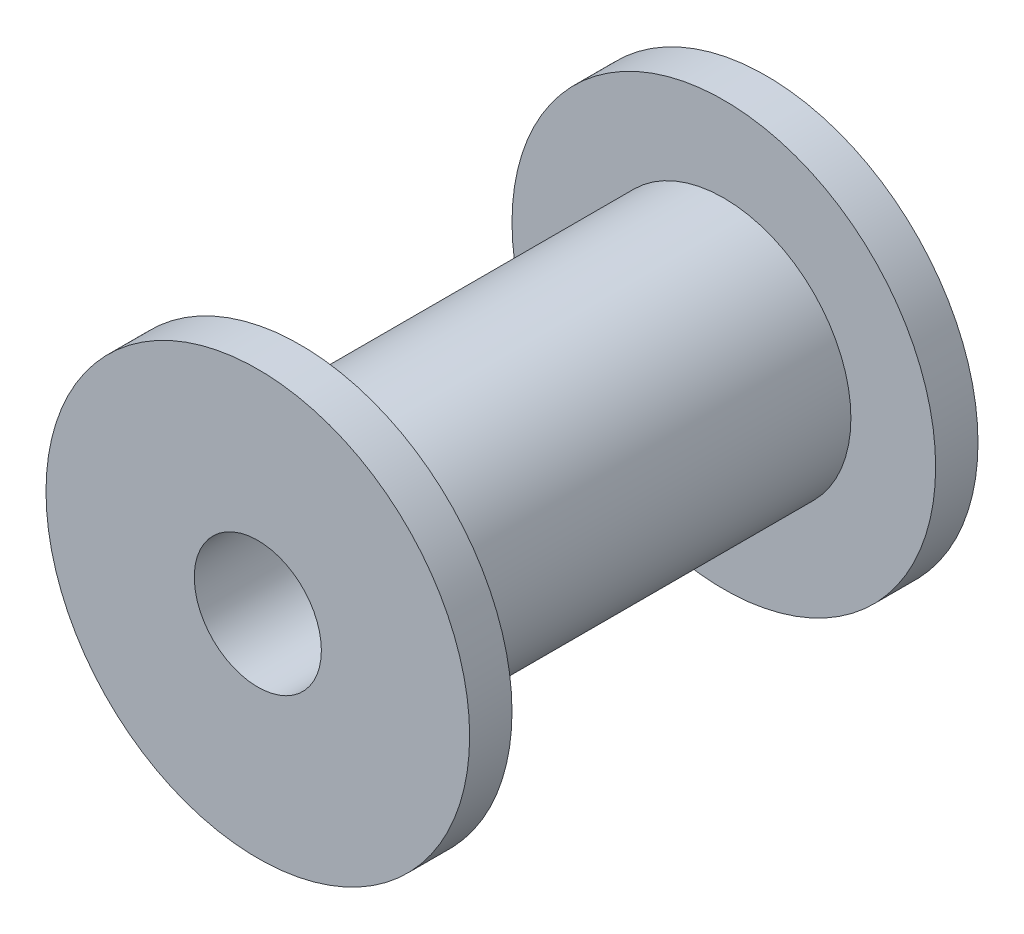
ISO-10303-21;
HEADER;
FILE_DESCRIPTION(('STEP AP214'),'2;1');
FILE_NAME('part.step','',(''),(''),'','','');
FILE_SCHEMA(('AUTOMOTIVE_DESIGN { 1 0 10303 214 1 1 1 1 }'));
ENDSEC;
DATA;
#1=APPLICATION_CONTEXT('core data for automotive mechanical design processes');
#2=APPLICATION_PROTOCOL_DEFINITION('international standard','automotive_design',2000,#1);
#3=PRODUCT_CONTEXT('',#1,'mechanical');
#4=PRODUCT('Part','Part','',(#3));
#5=PRODUCT_RELATED_PRODUCT_CATEGORY('part','',(#4));
#6=PRODUCT_DEFINITION_FORMATION('','',#4);
#7=PRODUCT_DEFINITION_CONTEXT('part definition',#1,'design');
#8=PRODUCT_DEFINITION('design','',#6,#7);
#9=PRODUCT_DEFINITION_SHAPE('','',#8);
#10=(LENGTH_UNIT() NAMED_UNIT(*) SI_UNIT(.MILLI.,.METRE.));
#11=(NAMED_UNIT(*) PLANE_ANGLE_UNIT() SI_UNIT($,.RADIAN.));
#12=(NAMED_UNIT(*) SI_UNIT($,.STERADIAN.) SOLID_ANGLE_UNIT());
#13=UNCERTAINTY_MEASURE_WITH_UNIT(LENGTH_MEASURE(1.E-05),#10,'distance_accuracy_value','');
#14=(GEOMETRIC_REPRESENTATION_CONTEXT(3) GLOBAL_UNCERTAINTY_ASSIGNED_CONTEXT((#13)) GLOBAL_UNIT_ASSIGNED_CONTEXT((#10,
#11,#12)) REPRESENTATION_CONTEXT('',''));
#15=CARTESIAN_POINT('',(0.,0.,0.));
#16=DIRECTION('',(0.,0.,1.));
#17=DIRECTION('',(1.,0.,0.));
#18=AXIS2_PLACEMENT_3D('',#15,#16,#17);
#19=CARTESIAN_POINT('',(0.,0.,15.875));
#20=DIRECTION('',(0.,0.,-1.));
#21=DIRECTION('',(-1.,0.,0.));
#22=AXIS2_PLACEMENT_3D('',#19,#20,#21);
#23=CYLINDRICAL_SURFACE('',#22,4.7625);
#24=CARTESIAN_POINT('',(0.,0.,19.05));
#25=DIRECTION('',(0.,0.,1.));
#26=DIRECTION('',(1.,0.,0.));
#27=AXIS2_PLACEMENT_3D('',#24,#25,#26);
#28=CIRCLE('',#27,4.7625);
#29=CARTESIAN_POINT('',(4.7625,0.,19.05));
#30=VERTEX_POINT('',#29);
#31=EDGE_CURVE('E60',#30,#30,#28,.T.);
#32=ORIENTED_EDGE('',*,*,#31,.T.);
#33=EDGE_LOOP('',(#32));
#34=FACE_BOUND('',#33,.T.);
#35=CARTESIAN_POINT('',(0.,0.,-19.05));
#36=DIRECTION('',(0.,0.,1.));
#37=DIRECTION('',(1.,0.,0.));
#38=AXIS2_PLACEMENT_3D('',#35,#36,#37);
#39=CIRCLE('',#38,4.7625);
#40=CARTESIAN_POINT('',(4.7625,0.,-19.05));
#41=VERTEX_POINT('',#40);
#42=EDGE_CURVE('E71',#41,#41,#39,.T.);
#43=ORIENTED_EDGE('',*,*,#42,.F.);
#44=EDGE_LOOP('',(#43));
#45=FACE_BOUND('',#44,.T.);
#46=ADVANCED_FACE('F45',(#34,#45),#23,.F.);
#47=CARTESIAN_POINT('',(0.,0.,15.875));
#48=DIRECTION('',(0.,0.,-1.));
#49=DIRECTION('',(-1.,0.,0.));
#50=AXIS2_PLACEMENT_3D('',#47,#48,#49);
#51=CYLINDRICAL_SURFACE('',#50,9.525);
#52=CARTESIAN_POINT('',(0.,0.,15.875));
#53=DIRECTION('',(0.,0.,1.));
#54=DIRECTION('',(1.,0.,0.));
#55=AXIS2_PLACEMENT_3D('',#52,#53,#54);
#56=CIRCLE('',#55,9.525);
#57=CARTESIAN_POINT('',(9.525,0.,15.875));
#58=VERTEX_POINT('',#57);
#59=EDGE_CURVE('E11',#58,#58,#56,.T.);
#60=ORIENTED_EDGE('',*,*,#59,.F.);
#61=EDGE_LOOP('',(#60));
#62=FACE_BOUND('',#61,.T.);
#63=CARTESIAN_POINT('',(0.,0.,-15.875));
#64=DIRECTION('',(0.,0.,1.));
#65=DIRECTION('',(1.,0.,0.));
#66=AXIS2_PLACEMENT_3D('',#63,#64,#65);
#67=CIRCLE('',#66,9.525);
#68=CARTESIAN_POINT('',(9.525,0.,-15.875));
#69=VERTEX_POINT('',#68);
#70=EDGE_CURVE('E64',#69,#69,#67,.T.);
#71=ORIENTED_EDGE('',*,*,#70,.T.);
#72=EDGE_LOOP('',(#71));
#73=FACE_BOUND('',#72,.T.);
#74=ADVANCED_FACE('F80',(#62,#73),#51,.T.);
#75=CARTESIAN_POINT('',(0.,0.,19.05));
#76=DIRECTION('',(0.,0.,1.));
#77=DIRECTION('',(1.,0.,0.));
#78=AXIS2_PLACEMENT_3D('',#75,#76,#77);
#79=PLANE('',#78);
#80=CARTESIAN_POINT('',(0.,0.,19.05));
#81=DIRECTION('',(0.,0.,1.));
#82=DIRECTION('',(1.,0.,0.));
#83=AXIS2_PLACEMENT_3D('',#80,#81,#82);
#84=CIRCLE('',#83,15.875);
#85=CARTESIAN_POINT('',(15.875,0.,19.05));
#86=VERTEX_POINT('',#85);
#87=EDGE_CURVE('E51',#86,#86,#84,.T.);
#88=ORIENTED_EDGE('',*,*,#87,.T.);
#89=EDGE_LOOP('',(#88));
#90=FACE_BOUND('',#89,.T.);
#91=ORIENTED_EDGE('',*,*,#31,.F.);
#92=EDGE_LOOP('',(#91));
#93=FACE_BOUND('',#92,.T.);
#94=ADVANCED_FACE('F86',(#90,#93),#79,.T.);
#95=CARTESIAN_POINT('',(0.,0.,15.875));
#96=DIRECTION('',(0.,0.,1.));
#97=DIRECTION('',(1.,0.,0.));
#98=AXIS2_PLACEMENT_3D('',#95,#96,#97);
#99=PLANE('',#98);
#100=ORIENTED_EDGE('',*,*,#59,.T.);
#101=EDGE_LOOP('',(#100));
#102=FACE_BOUND('',#101,.T.);
#103=CARTESIAN_POINT('',(0.,0.,15.875));
#104=DIRECTION('',(0.,0.,1.));
#105=DIRECTION('',(1.,0.,0.));
#106=AXIS2_PLACEMENT_3D('',#103,#104,#105);
#107=CIRCLE('',#106,15.875);
#108=CARTESIAN_POINT('',(15.875,0.,15.875));
#109=VERTEX_POINT('',#108);
#110=EDGE_CURVE('E55',#109,#109,#107,.T.);
#111=ORIENTED_EDGE('',*,*,#110,.F.);
#112=EDGE_LOOP('',(#111));
#113=FACE_BOUND('',#112,.T.);
#114=ADVANCED_FACE('F91',(#102,#113),#99,.F.);
#115=CARTESIAN_POINT('',(0.,0.,19.05));
#116=DIRECTION('',(0.,0.,-1.));
#117=DIRECTION('',(-1.,0.,0.));
#118=AXIS2_PLACEMENT_3D('',#115,#116,#117);
#119=CYLINDRICAL_SURFACE('',#118,15.875);
#120=ORIENTED_EDGE('',*,*,#87,.F.);
#121=EDGE_LOOP('',(#120));
#122=FACE_BOUND('',#121,.T.);
#123=ORIENTED_EDGE('',*,*,#110,.T.);
#124=EDGE_LOOP('',(#123));
#125=FACE_BOUND('',#124,.T.);
#126=ADVANCED_FACE('F96',(#122,#125),#119,.T.);
#127=CARTESIAN_POINT('',(0.,0.,-19.05));
#128=DIRECTION('',(0.,0.,-1.));
#129=DIRECTION('',(1.,0.,0.));
#130=AXIS2_PLACEMENT_3D('',#127,#128,#129);
#131=PLANE('',#130);
#132=CARTESIAN_POINT('',(0.,0.,-19.05));
#133=DIRECTION('',(0.,0.,1.));
#134=DIRECTION('',(1.,0.,0.));
#135=AXIS2_PLACEMENT_3D('',#132,#133,#134);
#136=CIRCLE('',#135,15.875);
#137=CARTESIAN_POINT('',(15.875,0.,-19.05));
#138=VERTEX_POINT('',#137);
#139=EDGE_CURVE('E67',#138,#138,#136,.T.);
#140=ORIENTED_EDGE('',*,*,#139,.F.);
#141=EDGE_LOOP('',(#140));
#142=FACE_BOUND('',#141,.T.);
#143=ORIENTED_EDGE('',*,*,#42,.T.);
#144=EDGE_LOOP('',(#143));
#145=FACE_BOUND('',#144,.T.);
#146=ADVANCED_FACE('F77',(#142,#145),#131,.T.);
#147=CARTESIAN_POINT('',(0.,0.,-15.875));
#148=DIRECTION('',(0.,0.,-1.));
#149=DIRECTION('',(1.,0.,0.));
#150=AXIS2_PLACEMENT_3D('',#147,#148,#149);
#151=PLANE('',#150);
#152=ORIENTED_EDGE('',*,*,#70,.F.);
#153=EDGE_LOOP('',(#152));
#154=FACE_BOUND('',#153,.T.);
#155=CARTESIAN_POINT('',(0.,0.,-15.875));
#156=DIRECTION('',(0.,0.,1.));
#157=DIRECTION('',(1.,0.,0.));
#158=AXIS2_PLACEMENT_3D('',#155,#156,#157);
#159=CIRCLE('',#158,15.875);
#160=CARTESIAN_POINT('',(15.875,0.,-15.875));
#161=VERTEX_POINT('',#160);
#162=EDGE_CURVE('E68',#161,#161,#159,.T.);
#163=ORIENTED_EDGE('',*,*,#162,.T.);
#164=EDGE_LOOP('',(#163));
#165=FACE_BOUND('',#164,.T.);
#166=ADVANCED_FACE('F109',(#154,#165),#151,.F.);
#167=CARTESIAN_POINT('',(0.,0.,-19.05));
#168=DIRECTION('',(0.,0.,1.));
#169=DIRECTION('',(-1.,0.,0.));
#170=AXIS2_PLACEMENT_3D('',#167,#168,#169);
#171=CYLINDRICAL_SURFACE('',#170,15.875);
#172=ORIENTED_EDGE('',*,*,#139,.T.);
#173=EDGE_LOOP('',(#172));
#174=FACE_BOUND('',#173,.T.);
#175=ORIENTED_EDGE('',*,*,#162,.F.);
#176=EDGE_LOOP('',(#175));
#177=FACE_BOUND('',#176,.T.);
#178=ADVANCED_FACE('F99',(#174,#177),#171,.T.);
#179=CLOSED_SHELL('',(#46,#74,#94,#114,#126,#146,#166,#178));
#180=MANIFOLD_SOLID_BREP('B2',#179);
#181=ADVANCED_BREP_SHAPE_REPRESENTATION('',(#18,#180),#14);
#182=SHAPE_DEFINITION_REPRESENTATION(#9,#181);
ENDSEC;
END-ISO-10303-21;
